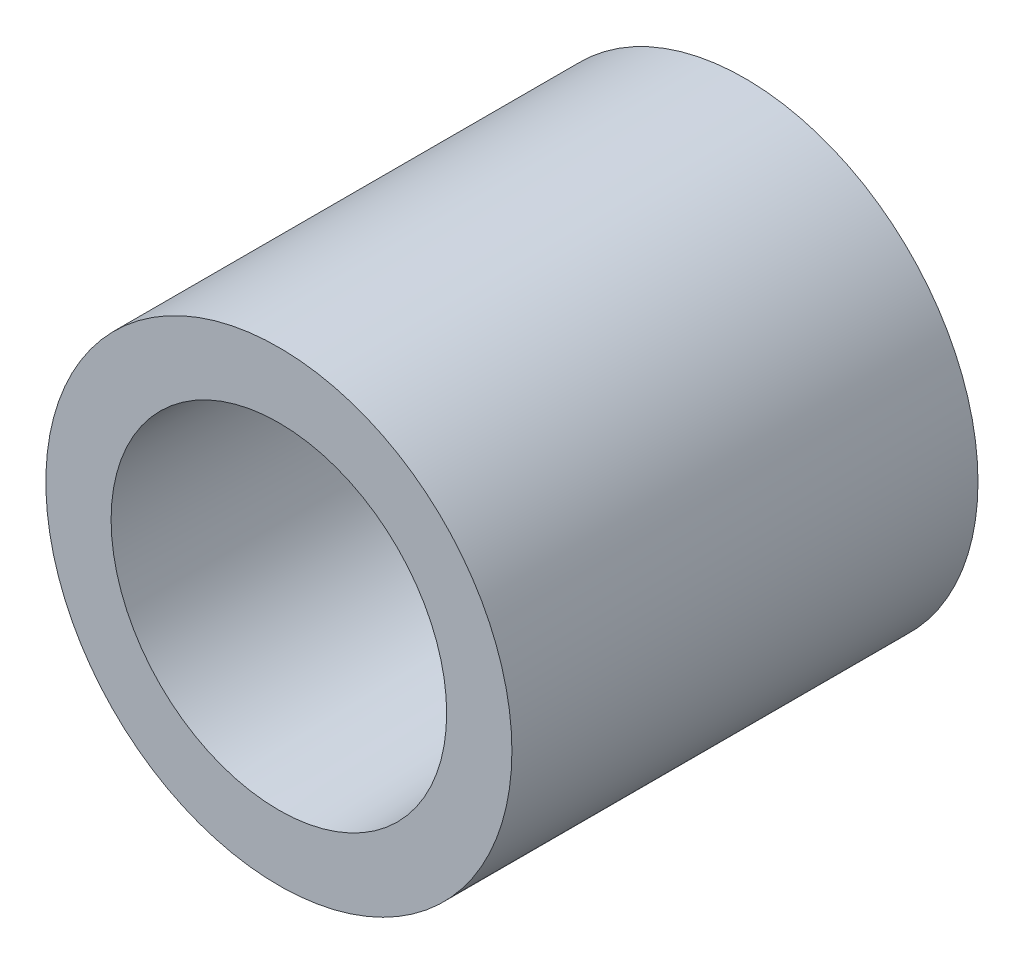
ISO-10303-21;
HEADER;
FILE_DESCRIPTION(('STEP AP214'),'2;1');
FILE_NAME('part.step','',(''),(''),'','','');
FILE_SCHEMA(('AUTOMOTIVE_DESIGN { 1 0 10303 214 1 1 1 1 }'));
ENDSEC;
DATA;
#1=APPLICATION_CONTEXT('core data for automotive mechanical design processes');
#2=APPLICATION_PROTOCOL_DEFINITION('international standard','automotive_design',2000,#1);
#3=PRODUCT_CONTEXT('',#1,'mechanical');
#4=PRODUCT('Part','Part','',(#3));
#5=PRODUCT_RELATED_PRODUCT_CATEGORY('part','',(#4));
#6=PRODUCT_DEFINITION_FORMATION('','',#4);
#7=PRODUCT_DEFINITION_CONTEXT('part definition',#1,'design');
#8=PRODUCT_DEFINITION('design','',#6,#7);
#9=PRODUCT_DEFINITION_SHAPE('','',#8);
#10=(LENGTH_UNIT() NAMED_UNIT(*) SI_UNIT(.MILLI.,.METRE.));
#11=(NAMED_UNIT(*) PLANE_ANGLE_UNIT() SI_UNIT($,.RADIAN.));
#12=(NAMED_UNIT(*) SI_UNIT($,.STERADIAN.) SOLID_ANGLE_UNIT());
#13=UNCERTAINTY_MEASURE_WITH_UNIT(LENGTH_MEASURE(1.E-05),#10,'distance_accuracy_value','');
#14=(GEOMETRIC_REPRESENTATION_CONTEXT(3) GLOBAL_UNCERTAINTY_ASSIGNED_CONTEXT((#13)) GLOBAL_UNIT_ASSIGNED_CONTEXT((#10,
#11,#12)) REPRESENTATION_CONTEXT('',''));
#15=CARTESIAN_POINT('',(0.,0.,0.));
#16=DIRECTION('',(0.,0.,1.));
#17=DIRECTION('',(1.,0.,0.));
#18=AXIS2_PLACEMENT_3D('',#15,#16,#17);
#19=CARTESIAN_POINT('',(0.,0.,19.05));
#20=DIRECTION('',(0.,0.,-1.));
#21=DIRECTION('',(-1.,0.,0.));
#22=AXIS2_PLACEMENT_3D('',#19,#20,#21);
#23=CYLINDRICAL_SURFACE('',#22,9.525);
#24=CARTESIAN_POINT('',(0.,0.,19.05));
#25=DIRECTION('',(0.,0.,1.));
#26=DIRECTION('',(1.,0.,0.));
#27=AXIS2_PLACEMENT_3D('',#24,#25,#26);
#28=CIRCLE('',#27,9.525);
#29=CARTESIAN_POINT('',(9.525,0.,19.05));
#30=VERTEX_POINT('',#29);
#31=EDGE_CURVE('E10',#30,#30,#28,.T.);
#32=ORIENTED_EDGE('',*,*,#31,.F.);
#33=EDGE_LOOP('',(#32));
#34=FACE_BOUND('',#33,.T.);
#35=CARTESIAN_POINT('',(0.,0.,0.));
#36=DIRECTION('',(0.,0.,1.));
#37=DIRECTION('',(1.,0.,0.));
#38=AXIS2_PLACEMENT_3D('',#35,#36,#37);
#39=CIRCLE('',#38,9.525);
#40=CARTESIAN_POINT('',(9.525,0.,0.));
#41=VERTEX_POINT('',#40);
#42=EDGE_CURVE('E38',#41,#41,#39,.T.);
#43=ORIENTED_EDGE('',*,*,#42,.T.);
#44=EDGE_LOOP('',(#43));
#45=FACE_BOUND('',#44,.T.);
#46=ADVANCED_FACE('F31',(#34,#45),#23,.T.);
#47=CARTESIAN_POINT('',(0.,0.,19.05));
#48=DIRECTION('',(0.,0.,1.));
#49=DIRECTION('',(1.,0.,0.));
#50=AXIS2_PLACEMENT_3D('',#47,#48,#49);
#51=PLANE('',#50);
#52=CARTESIAN_POINT('',(0.,0.,19.05));
#53=DIRECTION('',(0.,0.,1.));
#54=DIRECTION('',(1.,0.,0.));
#55=AXIS2_PLACEMENT_3D('',#52,#53,#54);
#56=CIRCLE('',#55,6.858);
#57=CARTESIAN_POINT('',(6.858,0.,19.05));
#58=VERTEX_POINT('',#57);
#59=EDGE_CURVE('E53',#58,#58,#56,.T.);
#60=ORIENTED_EDGE('',*,*,#59,.F.);
#61=EDGE_LOOP('',(#60));
#62=FACE_BOUND('',#61,.T.);
#63=ORIENTED_EDGE('',*,*,#31,.T.);
#64=EDGE_LOOP('',(#63));
#65=FACE_BOUND('',#64,.T.);
#66=ADVANCED_FACE('F72',(#62,#65),#51,.T.);
#67=CARTESIAN_POINT('',(0.,0.,0.));
#68=DIRECTION('',(0.,0.,1.));
#69=DIRECTION('',(1.,0.,0.));
#70=AXIS2_PLACEMENT_3D('',#67,#68,#69);
#71=PLANE('',#70);
#72=CARTESIAN_POINT('',(0.,0.,0.));
#73=DIRECTION('',(0.,0.,-1.));
#74=DIRECTION('',(-1.,0.,0.));
#75=AXIS2_PLACEMENT_3D('',#72,#73,#74);
#76=CIRCLE('',#75,1.5875);
#77=CARTESIAN_POINT('',(-1.5875,0.,0.));
#78=VERTEX_POINT('',#77);
#79=EDGE_CURVE('E62',#78,#78,#76,.T.);
#80=ORIENTED_EDGE('',*,*,#79,.F.);
#81=EDGE_LOOP('',(#80));
#82=FACE_BOUND('',#81,.T.);
#83=ORIENTED_EDGE('',*,*,#42,.F.);
#84=EDGE_LOOP('',(#83));
#85=FACE_BOUND('',#84,.T.);
#86=ADVANCED_FACE('F68',(#82,#85),#71,.F.);
#87=CARTESIAN_POINT('',(0.,0.,7.62));
#88=DIRECTION('',(0.,0.,1.));
#89=DIRECTION('',(1.,0.,0.));
#90=AXIS2_PLACEMENT_3D('',#87,#88,#89);
#91=CONICAL_SURFACE('',#90,5.5626,1.02974425867665);
#92=CARTESIAN_POINT('',(0.,0.,4.51611927877386));
#93=DIRECTION('',(0.,0.,1.));
#94=DIRECTION('',(1.,0.,0.));
#95=AXIS2_PLACEMENT_3D('',#92,#93,#94);
#96=CIRCLE('',#95,0.396874999999997);
#97=CARTESIAN_POINT('',(0.396874999999997,0.,4.51611927877386));
#98=VERTEX_POINT('',#97);
#99=EDGE_CURVE('E34',#98,#98,#96,.F.);
#100=ORIENTED_EDGE('',*,*,#99,.T.);
#101=EDGE_LOOP('',(#100));
#102=FACE_BOUND('',#101,.T.);
#103=CARTESIAN_POINT('',(0.,0.,7.62));
#104=DIRECTION('',(0.,0.,1.));
#105=DIRECTION('',(1.,0.,0.));
#106=AXIS2_PLACEMENT_3D('',#103,#104,#105);
#107=CIRCLE('',#106,5.5626);
#108=CARTESIAN_POINT('',(5.5626,0.,7.62));
#109=VERTEX_POINT('',#108);
#110=EDGE_CURVE('E43',#109,#109,#107,.T.);
#111=ORIENTED_EDGE('',*,*,#110,.T.);
#112=EDGE_LOOP('',(#111));
#113=FACE_BOUND('',#112,.T.);
#114=ADVANCED_FACE('F71',(#102,#113),#91,.F.);
#115=CARTESIAN_POINT('',(0.,0.,19.05));
#116=DIRECTION('',(0.,0.,1.));
#117=DIRECTION('',(1.,0.,0.));
#118=AXIS2_PLACEMENT_3D('',#115,#116,#117);
#119=CYLINDRICAL_SURFACE('',#118,5.5626);
#120=ORIENTED_EDGE('',*,*,#110,.F.);
#121=EDGE_LOOP('',(#120));
#122=FACE_BOUND('',#121,.T.);
#123=CARTESIAN_POINT('',(0.,0.,9.0297));
#124=DIRECTION('',(0.,0.,1.));
#125=DIRECTION('',(1.,0.,0.));
#126=AXIS2_PLACEMENT_3D('',#123,#124,#125);
#127=CIRCLE('',#126,5.5626);
#128=CARTESIAN_POINT('',(5.5626,0.,9.0297));
#129=VERTEX_POINT('',#128);
#130=EDGE_CURVE('E47',#129,#129,#127,.T.);
#131=ORIENTED_EDGE('',*,*,#130,.T.);
#132=EDGE_LOOP('',(#131));
#133=FACE_BOUND('',#132,.T.);
#134=ADVANCED_FACE('F88',(#122,#133),#119,.F.);
#135=CARTESIAN_POINT('',(5.5626,0.,9.0297));
#136=DIRECTION('',(0.,0.,-1.));
#137=DIRECTION('',(-1.,0.,0.));
#138=AXIS2_PLACEMENT_3D('',#135,#136,#137);
#139=PLANE('',#138);
#140=ORIENTED_EDGE('',*,*,#130,.F.);
#141=EDGE_LOOP('',(#140));
#142=FACE_BOUND('',#141,.T.);
#143=CARTESIAN_POINT('',(0.,0.,9.0297));
#144=DIRECTION('',(0.,0.,1.));
#145=DIRECTION('',(1.,0.,0.));
#146=AXIS2_PLACEMENT_3D('',#143,#144,#145);
#147=CIRCLE('',#146,6.55797879910953);
#148=CARTESIAN_POINT('',(6.55797879910953,0.,9.0297));
#149=VERTEX_POINT('',#148);
#150=EDGE_CURVE('E50',#149,#149,#147,.T.);
#151=ORIENTED_EDGE('',*,*,#150,.T.);
#152=EDGE_LOOP('',(#151));
#153=FACE_BOUND('',#152,.T.);
#154=ADVANCED_FACE('F92',(#142,#153),#139,.F.);
#155=CARTESIAN_POINT('',(0.,0.,19.05));
#156=DIRECTION('',(0.,0.,1.));
#157=DIRECTION('',(1.,0.,0.));
#158=AXIS2_PLACEMENT_3D('',#155,#156,#157);
#159=CONICAL_SURFACE('',#158,6.858,0.0299323966717026);
#160=ORIENTED_EDGE('',*,*,#150,.F.);
#161=EDGE_LOOP('',(#160));
#162=FACE_BOUND('',#161,.T.);
#163=ORIENTED_EDGE('',*,*,#59,.T.);
#164=EDGE_LOOP('',(#163));
#165=FACE_BOUND('',#164,.T.);
#166=ADVANCED_FACE('F96',(#162,#165),#159,.F.);
#167=CARTESIAN_POINT('',(0.,0.,0.));
#168=DIRECTION('',(0.,0.,-1.));
#169=DIRECTION('',(-1.,0.,0.));
#170=AXIS2_PLACEMENT_3D('',#167,#168,#169);
#171=CYLINDRICAL_SURFACE('',#170,0.396874999999997);
#172=CARTESIAN_POINT('',(0.,0.,3.175));
#173=DIRECTION('',(0.,0.,-1.));
#174=DIRECTION('',(-1.,0.,0.));
#175=AXIS2_PLACEMENT_3D('',#172,#173,#174);
#176=CIRCLE('',#175,0.396874999999998);
#177=CARTESIAN_POINT('',(-0.396874999999998,0.,3.175));
#178=VERTEX_POINT('',#177);
#179=EDGE_CURVE('E56',#178,#178,#176,.T.);
#180=ORIENTED_EDGE('',*,*,#179,.T.);
#181=EDGE_LOOP('',(#180));
#182=FACE_BOUND('',#181,.T.);
#183=ORIENTED_EDGE('',*,*,#99,.F.);
#184=EDGE_LOOP('',(#183));
#185=FACE_BOUND('',#184,.T.);
#186=ADVANCED_FACE('F100',(#182,#185),#171,.F.);
#187=CARTESIAN_POINT('',(0.396874999999998,0.,3.175));
#188=DIRECTION('',(0.,0.,1.));
#189=DIRECTION('',(1.,0.,0.));
#190=AXIS2_PLACEMENT_3D('',#187,#188,#189);
#191=PLANE('',#190);
#192=ORIENTED_EDGE('',*,*,#179,.F.);
#193=EDGE_LOOP('',(#192));
#194=FACE_BOUND('',#193,.T.);
#195=CARTESIAN_POINT('',(0.,0.,3.175));
#196=DIRECTION('',(0.,0.,-1.));
#197=DIRECTION('',(-1.,0.,0.));
#198=AXIS2_PLACEMENT_3D('',#195,#196,#197);
#199=CIRCLE('',#198,1.5875);
#200=CARTESIAN_POINT('',(-1.5875,0.,3.175));
#201=VERTEX_POINT('',#200);
#202=EDGE_CURVE('E59',#201,#201,#199,.T.);
#203=ORIENTED_EDGE('',*,*,#202,.T.);
#204=EDGE_LOOP('',(#203));
#205=FACE_BOUND('',#204,.T.);
#206=ADVANCED_FACE('F104',(#194,#205),#191,.F.);
#207=CARTESIAN_POINT('',(0.,0.,0.));
#208=DIRECTION('',(0.,0.,-1.));
#209=DIRECTION('',(-1.,0.,0.));
#210=AXIS2_PLACEMENT_3D('',#207,#208,#209);
#211=CYLINDRICAL_SURFACE('',#210,1.5875);
#212=ORIENTED_EDGE('',*,*,#202,.F.);
#213=EDGE_LOOP('',(#212));
#214=FACE_BOUND('',#213,.T.);
#215=ORIENTED_EDGE('',*,*,#79,.T.);
#216=EDGE_LOOP('',(#215));
#217=FACE_BOUND('',#216,.T.);
#218=ADVANCED_FACE('F66',(#214,#217),#211,.F.);
#219=CLOSED_SHELL('',(#46,#66,#86,#114,#134,#154,#166,#186,#206,#218));
#220=MANIFOLD_SOLID_BREP('B2',#219);
#221=ADVANCED_BREP_SHAPE_REPRESENTATION('',(#18,#220),#14);
#222=SHAPE_DEFINITION_REPRESENTATION(#9,#221);
ENDSEC;
END-ISO-10303-21;
